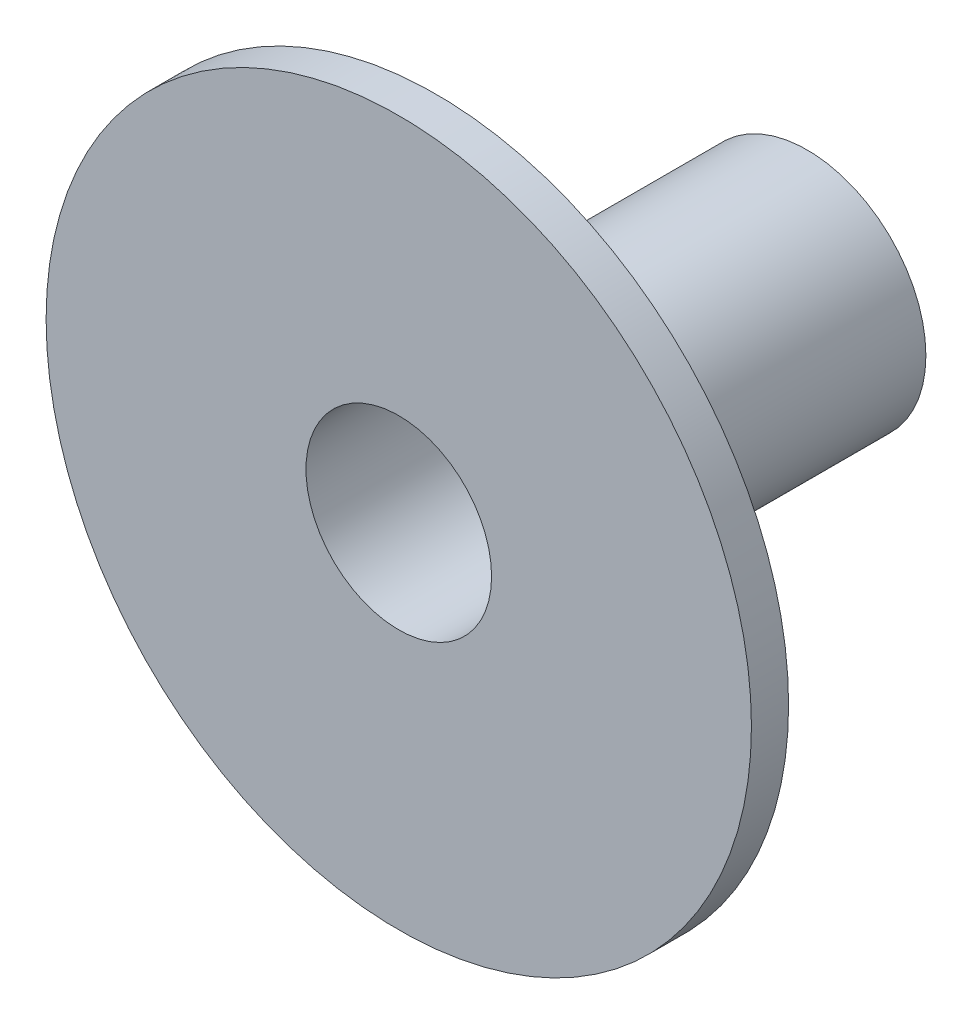
ISO-10303-21;
HEADER;
FILE_DESCRIPTION(('STEP AP214'),'2;1');
FILE_NAME('part.step','',(''),(''),'','','');
FILE_SCHEMA(('AUTOMOTIVE_DESIGN { 1 0 10303 214 1 1 1 1 }'));
ENDSEC;
DATA;
#1=APPLICATION_CONTEXT('core data for automotive mechanical design processes');
#2=APPLICATION_PROTOCOL_DEFINITION('international standard','automotive_design',2000,#1);
#3=PRODUCT_CONTEXT('',#1,'mechanical');
#4=PRODUCT('Part','Part','',(#3));
#5=PRODUCT_RELATED_PRODUCT_CATEGORY('part','',(#4));
#6=PRODUCT_DEFINITION_FORMATION('','',#4);
#7=PRODUCT_DEFINITION_CONTEXT('part definition',#1,'design');
#8=PRODUCT_DEFINITION('design','',#6,#7);
#9=PRODUCT_DEFINITION_SHAPE('','',#8);
#10=(LENGTH_UNIT() NAMED_UNIT(*) SI_UNIT(.MILLI.,.METRE.));
#11=(NAMED_UNIT(*) PLANE_ANGLE_UNIT() SI_UNIT($,.RADIAN.));
#12=(NAMED_UNIT(*) SI_UNIT($,.STERADIAN.) SOLID_ANGLE_UNIT());
#13=UNCERTAINTY_MEASURE_WITH_UNIT(LENGTH_MEASURE(1.E-05),#10,'distance_accuracy_value','');
#14=(GEOMETRIC_REPRESENTATION_CONTEXT(3) GLOBAL_UNCERTAINTY_ASSIGNED_CONTEXT((#13)) GLOBAL_UNIT_ASSIGNED_CONTEXT((#10,
#11,#12)) REPRESENTATION_CONTEXT('',''));
#15=CARTESIAN_POINT('',(0.,0.,0.));
#16=DIRECTION('',(0.,0.,1.));
#17=DIRECTION('',(1.,0.,0.));
#18=AXIS2_PLACEMENT_3D('',#15,#16,#17);
#19=CARTESIAN_POINT('',(0.,0.,-1.00076));
#20=DIRECTION('',(0.,0.,1.));
#21=DIRECTION('',(1.,0.,0.));
#22=AXIS2_PLACEMENT_3D('',#19,#20,#21);
#23=PLANE('',#22);
#24=CARTESIAN_POINT('',(0.,0.,-1.00076));
#25=DIRECTION('',(0.,0.,-1.));
#26=DIRECTION('',(-1.,0.,0.));
#27=AXIS2_PLACEMENT_3D('',#24,#25,#26);
#28=CIRCLE('',#27,9.4996);
#29=CARTESIAN_POINT('',(-9.4996,0.,-1.00076));
#30=VERTEX_POINT('',#29);
#31=EDGE_CURVE('E39',#30,#30,#28,.T.);
#32=ORIENTED_EDGE('',*,*,#31,.T.);
#33=EDGE_LOOP('',(#32));
#34=FACE_BOUND('',#33,.T.);
#35=CARTESIAN_POINT('',(0.,0.,-1.00076));
#36=DIRECTION('',(0.,0.,1.));
#37=DIRECTION('',(1.,0.,0.));
#38=AXIS2_PLACEMENT_3D('',#35,#36,#37);
#39=CIRCLE('',#38,3.19786);
#40=CARTESIAN_POINT('',(3.19786,0.,-1.00076));
#41=VERTEX_POINT('',#40);
#42=EDGE_CURVE('E10',#41,#41,#39,.F.);
#43=ORIENTED_EDGE('',*,*,#42,.F.);
#44=EDGE_LOOP('',(#43));
#45=FACE_BOUND('',#44,.T.);
#46=ADVANCED_FACE('F33',(#34,#45),#23,.F.);
#47=CARTESIAN_POINT('',(0.,0.,-1.00076));
#48=DIRECTION('',(0.,0.,-1.));
#49=DIRECTION('',(-1.,0.,0.));
#50=AXIS2_PLACEMENT_3D('',#47,#48,#49);
#51=CYLINDRICAL_SURFACE('',#50,9.4996);
#52=ORIENTED_EDGE('',*,*,#31,.F.);
#53=EDGE_LOOP('',(#52));
#54=FACE_BOUND('',#53,.T.);
#55=CARTESIAN_POINT('',(0.,0.,0.));
#56=DIRECTION('',(0.,0.,-1.));
#57=DIRECTION('',(-1.,0.,0.));
#58=AXIS2_PLACEMENT_3D('',#55,#56,#57);
#59=CIRCLE('',#58,9.4996);
#60=CARTESIAN_POINT('',(-9.4996,0.,0.));
#61=VERTEX_POINT('',#60);
#62=EDGE_CURVE('E43',#61,#61,#59,.T.);
#63=ORIENTED_EDGE('',*,*,#62,.T.);
#64=EDGE_LOOP('',(#63));
#65=FACE_BOUND('',#64,.T.);
#66=ADVANCED_FACE('F76',(#54,#65),#51,.T.);
#67=CARTESIAN_POINT('',(0.,0.,0.));
#68=DIRECTION('',(0.,0.,-1.));
#69=DIRECTION('',(-1.,0.,0.));
#70=AXIS2_PLACEMENT_3D('',#67,#68,#69);
#71=PLANE('',#70);
#72=CARTESIAN_POINT('',(0.,0.,0.));
#73=DIRECTION('',(0.,0.,1.));
#74=DIRECTION('',(1.,0.,0.));
#75=AXIS2_PLACEMENT_3D('',#72,#73,#74);
#76=CIRCLE('',#75,2.50000008);
#77=CARTESIAN_POINT('',(2.50000008,0.,0.));
#78=VERTEX_POINT('',#77);
#79=EDGE_CURVE('E47',#78,#78,#76,.T.);
#80=ORIENTED_EDGE('',*,*,#79,.F.);
#81=EDGE_LOOP('',(#80));
#82=FACE_BOUND('',#81,.T.);
#83=ORIENTED_EDGE('',*,*,#62,.F.);
#84=EDGE_LOOP('',(#83));
#85=FACE_BOUND('',#84,.T.);
#86=ADVANCED_FACE('F72',(#82,#85),#71,.F.);
#87=CARTESIAN_POINT('',(0.,0.,-2.54));
#88=DIRECTION('',(0.,0.,1.));
#89=DIRECTION('',(1.,0.,0.));
#90=AXIS2_PLACEMENT_3D('',#87,#88,#89);
#91=CYLINDRICAL_SURFACE('',#90,2.50000008);
#92=ORIENTED_EDGE('',*,*,#79,.T.);
#93=EDGE_LOOP('',(#92));
#94=FACE_BOUND('',#93,.T.);
#95=CARTESIAN_POINT('',(0.,0.,-11.00074));
#96=DIRECTION('',(0.,0.,-1.));
#97=DIRECTION('',(-1.,0.,0.));
#98=AXIS2_PLACEMENT_3D('',#95,#96,#97);
#99=CIRCLE('',#98,2.50000008);
#100=CARTESIAN_POINT('',(-2.50000008,0.,-11.00074));
#101=VERTEX_POINT('',#100);
#102=EDGE_CURVE('E55',#101,#101,#99,.T.);
#103=ORIENTED_EDGE('',*,*,#102,.T.);
#104=EDGE_LOOP('',(#103));
#105=FACE_BOUND('',#104,.T.);
#106=ADVANCED_FACE('F59',(#94,#105),#91,.F.);
#107=CARTESIAN_POINT('',(0.,0.,-11.00074));
#108=DIRECTION('',(0.,0.,-1.));
#109=DIRECTION('',(-1.,0.,0.));
#110=AXIS2_PLACEMENT_3D('',#107,#108,#109);
#111=PLANE('',#110);
#112=CARTESIAN_POINT('',(0.,0.,-11.00074));
#113=DIRECTION('',(0.,0.,-1.));
#114=DIRECTION('',(-1.,0.,0.));
#115=AXIS2_PLACEMENT_3D('',#112,#113,#114);
#116=CIRCLE('',#115,3.19786);
#117=CARTESIAN_POINT('',(-3.19786,0.,-11.00074));
#118=VERTEX_POINT('',#117);
#119=EDGE_CURVE('E52',#118,#118,#116,.T.);
#120=ORIENTED_EDGE('',*,*,#119,.T.);
#121=EDGE_LOOP('',(#120));
#122=FACE_BOUND('',#121,.T.);
#123=ORIENTED_EDGE('',*,*,#102,.F.);
#124=EDGE_LOOP('',(#123));
#125=FACE_BOUND('',#124,.T.);
#126=ADVANCED_FACE('F61',(#122,#125),#111,.T.);
#127=CARTESIAN_POINT('',(0.,0.,-11.00074));
#128=DIRECTION('',(0.,0.,1.));
#129=DIRECTION('',(1.,0.,0.));
#130=AXIS2_PLACEMENT_3D('',#127,#128,#129);
#131=CYLINDRICAL_SURFACE('',#130,3.19786);
#132=ORIENTED_EDGE('',*,*,#119,.F.);
#133=EDGE_LOOP('',(#132));
#134=FACE_BOUND('',#133,.T.);
#135=ORIENTED_EDGE('',*,*,#42,.T.);
#136=EDGE_LOOP('',(#135));
#137=FACE_BOUND('',#136,.T.);
#138=ADVANCED_FACE('F63',(#134,#137),#131,.T.);
#139=CLOSED_SHELL('',(#46,#66,#86,#106,#126,#138));
#140=MANIFOLD_SOLID_BREP('B2',#139);
#141=ADVANCED_BREP_SHAPE_REPRESENTATION('',(#18,#140),#14);
#142=SHAPE_DEFINITION_REPRESENTATION(#9,#141);
ENDSEC;
END-ISO-10303-21;
